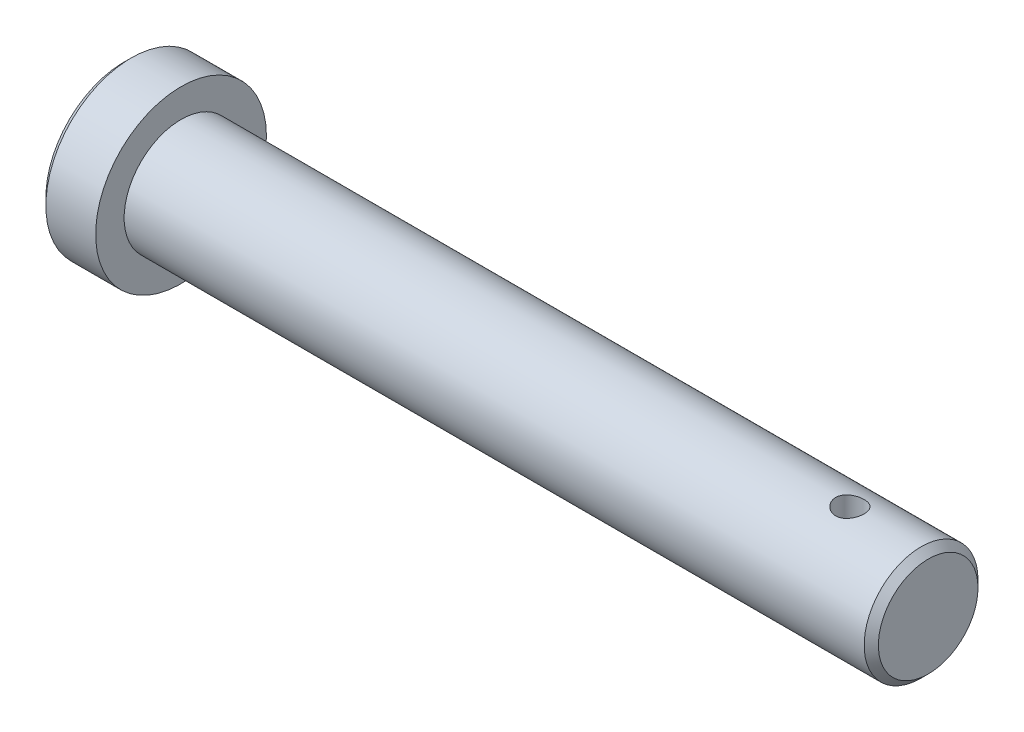
ISO-10303-21;
HEADER;
FILE_DESCRIPTION(('STEP AP214'),'2;1');
FILE_NAME('part.step','',(''),(''),'','','');
FILE_SCHEMA(('AUTOMOTIVE_DESIGN { 1 0 10303 214 1 1 1 1 }'));
ENDSEC;
DATA;
#1=APPLICATION_CONTEXT('core data for automotive mechanical design processes');
#2=APPLICATION_PROTOCOL_DEFINITION('international standard','automotive_design',2000,#1);
#3=PRODUCT_CONTEXT('',#1,'mechanical');
#4=PRODUCT('Part','Part','',(#3));
#5=PRODUCT_RELATED_PRODUCT_CATEGORY('part','',(#4));
#6=PRODUCT_DEFINITION_FORMATION('','',#4);
#7=PRODUCT_DEFINITION_CONTEXT('part definition',#1,'design');
#8=PRODUCT_DEFINITION('design','',#6,#7);
#9=PRODUCT_DEFINITION_SHAPE('','',#8);
#10=(LENGTH_UNIT() NAMED_UNIT(*) SI_UNIT(.MILLI.,.METRE.));
#11=(NAMED_UNIT(*) PLANE_ANGLE_UNIT() SI_UNIT($,.RADIAN.));
#12=(NAMED_UNIT(*) SI_UNIT($,.STERADIAN.) SOLID_ANGLE_UNIT());
#13=UNCERTAINTY_MEASURE_WITH_UNIT(LENGTH_MEASURE(1.E-05),#10,'distance_accuracy_value','');
#14=(GEOMETRIC_REPRESENTATION_CONTEXT(3) GLOBAL_UNCERTAINTY_ASSIGNED_CONTEXT((#13)) GLOBAL_UNIT_ASSIGNED_CONTEXT((#10,
#11,#12)) REPRESENTATION_CONTEXT('',''));
#15=CARTESIAN_POINT('',(0.,0.,0.));
#16=DIRECTION('',(0.,0.,1.));
#17=DIRECTION('',(1.,0.,0.));
#18=AXIS2_PLACEMENT_3D('',#15,#16,#17);
#19=CARTESIAN_POINT('',(8.,0.,0.));
#20=DIRECTION('',(1.,0.,0.));
#21=DIRECTION('',(0.,0.,-1.));
#22=AXIS2_PLACEMENT_3D('',#19,#20,#21);
#23=PLANE('',#22);
#24=CARTESIAN_POINT('',(8.,0.,0.));
#25=DIRECTION('',(1.,0.,0.));
#26=DIRECTION('',(0.,0.,-1.));
#27=AXIS2_PLACEMENT_3D('',#24,#25,#26);
#28=CIRCLE('',#27,12.);
#29=CARTESIAN_POINT('',(8.,0.,-12.));
#30=VERTEX_POINT('',#29);
#31=EDGE_CURVE('E98',#30,#30,#28,.T.);
#32=ORIENTED_EDGE('',*,*,#31,.T.);
#33=EDGE_LOOP('',(#32));
#34=FACE_BOUND('',#33,.T.);
#35=CARTESIAN_POINT('',(8.,0.,0.));
#36=DIRECTION('',(1.,0.,0.));
#37=DIRECTION('',(0.,0.,-1.));
#38=AXIS2_PLACEMENT_3D('',#35,#36,#37);
#39=CIRCLE('',#38,8.);
#40=CARTESIAN_POINT('',(8.,0.,-8.));
#41=VERTEX_POINT('',#40);
#42=EDGE_CURVE('E100',#41,#41,#39,.T.);
#43=ORIENTED_EDGE('',*,*,#42,.F.);
#44=EDGE_LOOP('',(#43));
#45=FACE_BOUND('',#44,.T.);
#46=ADVANCED_FACE('F31',(#34,#45),#23,.T.);
#47=CARTESIAN_POINT('',(8.,0.,0.));
#48=DIRECTION('',(-1.,0.,0.));
#49=DIRECTION('',(0.,0.,1.));
#50=AXIS2_PLACEMENT_3D('',#47,#48,#49);
#51=CYLINDRICAL_SURFACE('',#50,12.);
#52=CARTESIAN_POINT('',(1.,0.,0.));
#53=DIRECTION('',(1.,0.,0.));
#54=DIRECTION('',(0.,0.,-1.));
#55=AXIS2_PLACEMENT_3D('',#52,#53,#54);
#56=CIRCLE('',#55,12.);
#57=CARTESIAN_POINT('',(1.,0.,-12.));
#58=VERTEX_POINT('',#57);
#59=EDGE_CURVE('E97',#58,#58,#56,.T.);
#60=ORIENTED_EDGE('',*,*,#59,.T.);
#61=EDGE_LOOP('',(#60));
#62=FACE_BOUND('',#61,.T.);
#63=ORIENTED_EDGE('',*,*,#31,.F.);
#64=EDGE_LOOP('',(#63));
#65=FACE_BOUND('',#64,.T.);
#66=ADVANCED_FACE('F75',(#62,#65),#51,.T.);
#67=CARTESIAN_POINT('',(0.,0.,0.));
#68=DIRECTION('',(1.,0.,0.));
#69=DIRECTION('',(0.,0.,-1.));
#70=AXIS2_PLACEMENT_3D('',#67,#68,#69);
#71=PLANE('',#70);
#72=CARTESIAN_POINT('',(0.,0.,0.));
#73=DIRECTION('',(1.,0.,0.));
#74=DIRECTION('',(0.,0.,-1.));
#75=AXIS2_PLACEMENT_3D('',#72,#73,#74);
#76=CIRCLE('',#75,11.);
#77=CARTESIAN_POINT('',(0.,0.,-11.));
#78=VERTEX_POINT('',#77);
#79=EDGE_CURVE('E48',#78,#78,#76,.F.);
#80=ORIENTED_EDGE('',*,*,#79,.T.);
#81=EDGE_LOOP('',(#80));
#82=FACE_BOUND('',#81,.T.);
#83=ADVANCED_FACE('F80',(#82),#71,.F.);
#84=CARTESIAN_POINT('',(1.,0.,0.));
#85=DIRECTION('',(1.,0.,0.));
#86=DIRECTION('',(0.,0.,-1.));
#87=AXIS2_PLACEMENT_3D('',#84,#85,#86);
#88=CONICAL_SURFACE('',#87,12.,0.78539816339745);
#89=ORIENTED_EDGE('',*,*,#79,.F.);
#90=EDGE_LOOP('',(#89));
#91=FACE_BOUND('',#90,.T.);
#92=ORIENTED_EDGE('',*,*,#59,.F.);
#93=EDGE_LOOP('',(#92));
#94=FACE_BOUND('',#93,.T.);
#95=ADVANCED_FACE('F72',(#91,#94),#88,.T.);
#96=CARTESIAN_POINT('',(113.,0.,0.));
#97=DIRECTION('',(-1.,0.,0.));
#98=DIRECTION('',(0.,0.,1.));
#99=AXIS2_PLACEMENT_3D('',#96,#97,#98);
#100=CYLINDRICAL_SURFACE('',#99,8.);
#101=CARTESIAN_POINT('',(102.,-7.74596669241483,2.));
#102=CARTESIAN_POINT('',(102.110440600741,-7.74596880070288,1.99999686287445));
#103=CARTESIAN_POINT('',(102.220915918943,-7.74835444811678,1.99082099639812));
#104=CARTESIAN_POINT('',(102.438694062539,-7.75761489594051,1.95441850037103));
#105=CARTESIAN_POINT('',(102.545995003575,-7.76449230897304,1.92718136539368));
#106=CARTESIAN_POINT('',(102.75424283055,-7.7819097967692,1.85559295970563));
#107=CARTESIAN_POINT('',(102.855197724309,-7.79244514152366,1.81126378228359));
#108=CARTESIAN_POINT('',(103.048248682032,-7.81598553623007,1.70681691300911));
#109=CARTESIAN_POINT('',(103.140344369664,-7.82899069102791,1.64669855084855));
#110=CARTESIAN_POINT('',(103.31508931621,-7.856325730845,1.51096674184951));
#111=CARTESIAN_POINT('',(103.39751488028,-7.87067678098427,1.43506951016325));
#112=CARTESIAN_POINT('',(103.548609115488,-7.89890300412235,1.27054565128054));
#113=CARTESIAN_POINT('',(103.617276500497,-7.91277813253111,1.18191783534426));
#114=CARTESIAN_POINT('',(103.739820374105,-7.93872332416466,0.992916160863172));
#115=CARTESIAN_POINT('',(103.793477110529,-7.95076549920474,0.892395660956105));
#116=CARTESIAN_POINT('',(103.883047715322,-7.97144649540787,0.683410547434216));
#117=CARTESIAN_POINT('',(103.918964201532,-7.98008581867475,0.574947108633554));
#118=CARTESIAN_POINT('',(103.971318267663,-7.99283807078544,0.355487007003329));
#119=CARTESIAN_POINT('',(103.988135715461,-7.99703915075451,0.244586175639181));
#120=CARTESIAN_POINT('',(104.00300670342,-8.00074875285838,0.0214630554102188));
#121=CARTESIAN_POINT('',(104.001063017768,-8.00025796877363,-0.0907590356304507));
#122=CARTESIAN_POINT('',(103.9787401198,-7.99470475962828,-0.310704494344769));
#123=CARTESIAN_POINT('',(103.958770939957,-7.98974401872699,-0.418472431202127));
#124=CARTESIAN_POINT('',(103.901622983961,-7.97592669219883,-0.629076494827365));
#125=CARTESIAN_POINT('',(103.864443291698,-7.96706989918753,-0.73191235874087));
#126=CARTESIAN_POINT('',(103.77359794345,-7.94630007760716,-0.930813407003608));
#127=CARTESIAN_POINT('',(103.719786364271,-7.93436015756043,-1.026809019533));
#128=CARTESIAN_POINT('',(103.597315456707,-7.90871923047719,-1.20855124468097));
#129=CARTESIAN_POINT('',(103.528653545151,-7.89501791721992,-1.29429607017101));
#130=CARTESIAN_POINT('',(103.376233006414,-7.86690971015616,-1.4555480701699));
#131=CARTESIAN_POINT('',(103.292116086122,-7.85249375620734,-1.53071535815039));
#132=CARTESIAN_POINT('',(103.112320021168,-7.82492034813365,-1.66595275192603));
#133=CARTESIAN_POINT('',(103.016640336407,-7.81176295284777,-1.72602215209203));
#134=CARTESIAN_POINT('',(102.815767972681,-7.78816397465319,-1.82957625804519));
#135=CARTESIAN_POINT('',(102.710531415749,-7.77773586980577,-1.87297913394098));
#136=CARTESIAN_POINT('',(102.493931625539,-7.76094912111966,-1.94137124127268));
#137=CARTESIAN_POINT('',(102.382569708813,-7.75458960648175,-1.96636441310582));
#138=CARTESIAN_POINT('',(102.160032398781,-7.74684284831313,-1.99666371093214));
#139=CARTESIAN_POINT('',(102.048929765336,-7.74532871274919,-2.0024723791357));
#140=CARTESIAN_POINT('',(101.827342450737,-7.74709874784831,-1.99561359241243));
#141=CARTESIAN_POINT('',(101.716857713639,-7.75038247681013,-1.98294783827904));
#142=CARTESIAN_POINT('',(101.501508588036,-7.76125665563648,-1.93994037115013));
#143=CARTESIAN_POINT('',(101.396581818743,-7.768775761875,-1.90989125462539));
#144=CARTESIAN_POINT('',(101.193254833719,-7.7872057461677,-1.83329446533649));
#145=CARTESIAN_POINT('',(101.094855392756,-7.79811702598891,-1.78674483817003));
#146=CARTESIAN_POINT('',(100.905246977706,-7.8223690967461,-1.67741653434924));
#147=CARTESIAN_POINT('',(100.814216927966,-7.83575334885314,-1.61433740306849));
#148=CARTESIAN_POINT('',(100.643849309759,-7.86333666457373,-1.4741205858689));
#149=CARTESIAN_POINT('',(100.56451366668,-7.87753586182776,-1.39698058961087));
#150=CARTESIAN_POINT('',(100.417751165943,-7.90557922425285,-1.22852544196944));
#151=CARTESIAN_POINT('',(100.350671949961,-7.91940561649468,-1.13690390506318));
#152=CARTESIAN_POINT('',(100.232851306439,-7.94477773290987,-0.943405365389353));
#153=CARTESIAN_POINT('',(100.182109026713,-7.95632357603169,-0.841528897915187));
#154=CARTESIAN_POINT('',(100.098843172378,-7.9757609259065,-0.631116403462189));
#155=CARTESIAN_POINT('',(100.066188572497,-7.98367864017925,-0.522634762055773));
#156=CARTESIAN_POINT('',(100.019631732313,-7.99508234716634,-0.301499520637622));
#157=CARTESIAN_POINT('',(100.005725873009,-7.99856919514738,-0.188846730082488));
#158=CARTESIAN_POINT('',(99.9972648208489,-8.00068338817612,0.0341670528866387));
#159=CARTESIAN_POINT('',(100.002196581809,-7.99943957759977,0.144507653932035));
#160=CARTESIAN_POINT('',(100.030095654589,-7.99251792914887,0.362734992829493));
#161=CARTESIAN_POINT('',(100.053062430026,-7.98684022314338,0.470621803561851));
#162=CARTESIAN_POINT('',(100.116104439542,-7.97170865707778,0.680342071289543));
#163=CARTESIAN_POINT('',(100.156086906629,-7.96227529004785,0.782204989161721));
#164=CARTESIAN_POINT('',(100.251941158039,-7.94062577827316,0.977834106083244));
#165=CARTESIAN_POINT('',(100.307814945341,-7.92840928277515,1.07159928253126));
#166=CARTESIAN_POINT('',(100.435430467992,-7.90214499360574,1.2508038568466));
#167=CARTESIAN_POINT('',(100.507520285808,-7.88806033883329,1.33598997659666));
#168=CARTESIAN_POINT('',(100.664845703955,-7.8598129811438,1.493230040547));
#169=CARTESIAN_POINT('',(100.750084632222,-7.84565025934605,1.56528065015317));
#170=CARTESIAN_POINT('',(100.933202828379,-7.81854951691005,1.69552405294366));
#171=CARTESIAN_POINT('',(101.03128824673,-7.80563927346578,1.75343323883275));
#172=CARTESIAN_POINT('',(101.23611097975,-7.78287910989656,1.85185379317093));
#173=CARTESIAN_POINT('',(101.342841932188,-7.77302696466428,1.8923778195043));
#174=CARTESIAN_POINT('',(101.54115402367,-7.75903817501475,1.948845057142));
#175=CARTESIAN_POINT('',(101.631786328772,-7.75417326006998,1.96798634119375));
#176=CARTESIAN_POINT('',(101.814937737995,-7.7476367716524,1.99356458514353));
#177=CARTESIAN_POINT('',(101.907456680489,-7.74596492578216,2.0000026287435));
#178=CARTESIAN_POINT('',(102.,-7.74596669241483,2.));
#179=B_SPLINE_CURVE_WITH_KNOTS('',3,(#101,#102,#103,#104,#105,#106,#107,#108,#109,#110,#111,
#112,#113,#114,#115,#116,#117,#118,#119,#120,#121,#122,#123,#124,#125,#126,#127,#128,#129,#130,
#131,#132,#133,#134,#135,#136,#137,#138,#139,#140,#141,#142,#143,#144,#145,#146,#147,#148,#149,
#150,#151,#152,#153,#154,#155,#156,#157,#158,#159,#160,#161,#162,#163,#164,#165,#166,#167,#168,
#169,#170,#171,#172,#173,#174,#175,#176,#177,#178),.UNSPECIFIED.,.T.,.F.,(4,2,2,2,2,2,2,2,2,2,2,
2,2,2,2,2,2,2,2,2,2,2,2,2,2,2,2,2,2,2,2,2,2,2,2,2,2,2,4),(0.,0.330981953388902,
0.662156593142927,0.992904581732803,1.32366661404381,1.66099163354378,1.99834817183891,
2.34041197118335,2.68242527877673,3.01751000796276,3.35254518932815,3.68014610151156,
4.00776445379828,4.33834299403555,4.66897908375129,5.00856373257526,5.3481642495984,
5.6894114560672,6.03058560103637,6.36274859809372,6.69488101747039,7.02157924007365,
7.34831617137133,7.68146276687326,8.01466415108035,8.35620264772253,8.6977233257564,
9.03673658245541,9.37568439127228,9.70546756901963,10.0352409390158,10.3632390124777,
10.6912784459046,11.0271767726565,11.363160252524,11.7054118182895,12.0474137709605,
12.3247826174462,12.6021278008237),.UNSPECIFIED.);
#180=CARTESIAN_POINT('',(102.,-7.74596669241483,2.));
#181=VERTEX_POINT('',#180);
#182=EDGE_CURVE('E35',#181,#181,#179,.T.);
#183=ORIENTED_EDGE('',*,*,#182,.T.);
#184=EDGE_LOOP('',(#183));
#185=FACE_BOUND('',#184,.T.);
#186=CARTESIAN_POINT('',(102.,7.74596669241483,2.));
#187=CARTESIAN_POINT('',(101.889559399259,7.74596880070288,1.99999686287445));
#188=CARTESIAN_POINT('',(101.779084081057,7.74835444811678,1.99082099639812));
#189=CARTESIAN_POINT('',(101.561305937461,7.75761489594051,1.95441850037103));
#190=CARTESIAN_POINT('',(101.454004996425,7.76449230897304,1.92718136539368));
#191=CARTESIAN_POINT('',(101.24575716945,7.7819097967692,1.85559295970563));
#192=CARTESIAN_POINT('',(101.144802275691,7.79244514152366,1.81126378228359));
#193=CARTESIAN_POINT('',(100.951751317968,7.81598553623007,1.70681691300911));
#194=CARTESIAN_POINT('',(100.859655630336,7.82899069102791,1.64669855084855));
#195=CARTESIAN_POINT('',(100.68491068379,7.856325730845,1.51096674184951));
#196=CARTESIAN_POINT('',(100.60248511972,7.87067678098427,1.43506951016325));
#197=CARTESIAN_POINT('',(100.451390884512,7.89890300412235,1.27054565128054));
#198=CARTESIAN_POINT('',(100.382723499503,7.91277813253111,1.18191783534426));
#199=CARTESIAN_POINT('',(100.260179625895,7.93872332416466,0.992916160863172));
#200=CARTESIAN_POINT('',(100.206522889471,7.95076549920474,0.892395660956105));
#201=CARTESIAN_POINT('',(100.116952284678,7.97144649540787,0.683410547434216));
#202=CARTESIAN_POINT('',(100.081035798468,7.98008581867475,0.574947108633554));
#203=CARTESIAN_POINT('',(100.028681732337,7.99283807078544,0.355487007003329));
#204=CARTESIAN_POINT('',(100.011864284539,7.99703915075451,0.244586175639181));
#205=CARTESIAN_POINT('',(99.9969932965796,8.00074875285838,0.0214630554102188));
#206=CARTESIAN_POINT('',(99.9989369822323,8.00025796877363,-0.0907590356304507));
#207=CARTESIAN_POINT('',(100.0212598802,7.99470475962828,-0.310704494344769));
#208=CARTESIAN_POINT('',(100.041229060043,7.98974401872699,-0.418472431202127));
#209=CARTESIAN_POINT('',(100.098377016039,7.97592669219883,-0.629076494827365));
#210=CARTESIAN_POINT('',(100.135556708302,7.96706989918753,-0.73191235874087));
#211=CARTESIAN_POINT('',(100.22640205655,7.94630007760716,-0.930813407003608));
#212=CARTESIAN_POINT('',(100.280213635729,7.93436015756043,-1.026809019533));
#213=CARTESIAN_POINT('',(100.402684543293,7.90871923047719,-1.20855124468097));
#214=CARTESIAN_POINT('',(100.471346454849,7.89501791721992,-1.29429607017101));
#215=CARTESIAN_POINT('',(100.623766993586,7.86690971015616,-1.4555480701699));
#216=CARTESIAN_POINT('',(100.707883913878,7.85249375620734,-1.53071535815039));
#217=CARTESIAN_POINT('',(100.887679978832,7.82492034813365,-1.66595275192603));
#218=CARTESIAN_POINT('',(100.983359663593,7.81176295284777,-1.72602215209203));
#219=CARTESIAN_POINT('',(101.184232027319,7.78816397465319,-1.82957625804519));
#220=CARTESIAN_POINT('',(101.289468584251,7.77773586980577,-1.87297913394098));
#221=CARTESIAN_POINT('',(101.506068374461,7.76094912111966,-1.94137124127268));
#222=CARTESIAN_POINT('',(101.617430291186,7.75458960648175,-1.96636441310582));
#223=CARTESIAN_POINT('',(101.839967601218,7.74684284831313,-1.99666371093214));
#224=CARTESIAN_POINT('',(101.951070234664,7.74532871274919,-2.0024723791357));
#225=CARTESIAN_POINT('',(102.172657549263,7.74709874784831,-1.99561359241243));
#226=CARTESIAN_POINT('',(102.283142286361,7.75038247681013,-1.98294783827904));
#227=CARTESIAN_POINT('',(102.498491411964,7.76125665563648,-1.93994037115013));
#228=CARTESIAN_POINT('',(102.603418181257,7.768775761875,-1.9098912546254));
#229=CARTESIAN_POINT('',(102.806745166281,7.7872057461677,-1.8332944653365));
#230=CARTESIAN_POINT('',(102.905144607244,7.79811702598891,-1.78674483817003));
#231=CARTESIAN_POINT('',(103.094753022294,7.8223690967461,-1.67741653434924));
#232=CARTESIAN_POINT('',(103.185783072034,7.83575334885313,-1.6143374030685));
#233=CARTESIAN_POINT('',(103.356150690241,7.86333666457373,-1.4741205858689));
#234=CARTESIAN_POINT('',(103.43548633332,7.87753586182776,-1.39698058961087));
#235=CARTESIAN_POINT('',(103.582248834057,7.90557922425285,-1.22852544196944));
#236=CARTESIAN_POINT('',(103.649328050039,7.91940561649468,-1.13690390506318));
#237=CARTESIAN_POINT('',(103.767148693561,7.94477773290987,-0.943405365389353));
#238=CARTESIAN_POINT('',(103.817890973287,7.95632357603169,-0.841528897915187));
#239=CARTESIAN_POINT('',(103.901156827622,7.9757609259065,-0.631116403462189));
#240=CARTESIAN_POINT('',(103.933811427503,7.98367864017925,-0.522634762055773));
#241=CARTESIAN_POINT('',(103.980368267687,7.99508234716634,-0.301499520637622));
#242=CARTESIAN_POINT('',(103.994274126991,7.99856919514738,-0.188846730082488));
#243=CARTESIAN_POINT('',(104.002735179151,8.00068338817612,0.0341670528866387));
#244=CARTESIAN_POINT('',(103.997803418191,7.99943957759977,0.144507653932035));
#245=CARTESIAN_POINT('',(103.969904345411,7.99251792914887,0.362734992829493));
#246=CARTESIAN_POINT('',(103.946937569974,7.98684022314338,0.470621803561851));
#247=CARTESIAN_POINT('',(103.883895560458,7.97170865707778,0.680342071289542));
#248=CARTESIAN_POINT('',(103.843913093371,7.96227529004785,0.782204989161717));
#249=CARTESIAN_POINT('',(103.748058841961,7.94062577827316,0.977834106083241));
#250=CARTESIAN_POINT('',(103.692185054659,7.92840928277515,1.07159928253126));
#251=CARTESIAN_POINT('',(103.564569532008,7.90214499360574,1.2508038568466));
#252=CARTESIAN_POINT('',(103.492479714192,7.88806033883329,1.33598997659666));
#253=CARTESIAN_POINT('',(103.335154296045,7.8598129811438,1.493230040547));
#254=CARTESIAN_POINT('',(103.249915367778,7.84565025934605,1.56528065015317));
#255=CARTESIAN_POINT('',(103.066797171621,7.81854951691005,1.69552405294366));
#256=CARTESIAN_POINT('',(102.968711753269,7.80563927346578,1.75343323883275));
#257=CARTESIAN_POINT('',(102.76388902025,7.78287910989656,1.85185379317093));
#258=CARTESIAN_POINT('',(102.657158067812,7.77302696466428,1.8923778195043));
#259=CARTESIAN_POINT('',(102.45884597633,7.75903817501475,1.948845057142));
#260=CARTESIAN_POINT('',(102.368213671228,7.75417326006998,1.96798634119375));
#261=CARTESIAN_POINT('',(102.185062262005,7.7476367716524,1.99356458514353));
#262=CARTESIAN_POINT('',(102.092543319511,7.74596492578216,2.0000026287435));
#263=CARTESIAN_POINT('',(102.,7.74596669241483,2.));
#264=B_SPLINE_CURVE_WITH_KNOTS('',3,(#186,#187,#188,#189,#190,#191,#192,#193,#194,#195,#196,
#197,#198,#199,#200,#201,#202,#203,#204,#205,#206,#207,#208,#209,#210,#211,#212,#213,#214,#215,
#216,#217,#218,#219,#220,#221,#222,#223,#224,#225,#226,#227,#228,#229,#230,#231,#232,#233,#234,
#235,#236,#237,#238,#239,#240,#241,#242,#243,#244,#245,#246,#247,#248,#249,#250,#251,#252,#253,
#254,#255,#256,#257,#258,#259,#260,#261,#262,#263),.UNSPECIFIED.,.T.,.F.,(4,2,2,2,2,2,2,2,2,2,2,
2,2,2,2,2,2,2,2,2,2,2,2,2,2,2,2,2,2,2,2,2,2,2,2,2,2,2,4),(0.,0.330981953388917,
0.662156593142927,0.992904581732803,1.32366661404381,1.66099163354378,1.99834817183891,
2.34041197118335,2.68242527877673,3.01751000796276,3.35254518932815,3.68014610151156,
4.00776445379828,4.33834299403555,4.66897908375129,5.00856373257526,5.3481642495984,
5.6894114560672,6.03058560103637,6.36274859809372,6.69488101747039,7.02157924007363,
7.34831617137133,7.68146276687325,8.01466415108035,8.35620264772253,8.6977233257564,
9.03673658245541,9.37568439127228,9.70546756901963,10.0352409390158,10.3632390124777,
10.6912784459046,11.0271767726565,11.363160252524,11.7054118182895,12.0474137709605,
12.3247826174462,12.6021278008237),.UNSPECIFIED.);
#265=CARTESIAN_POINT('',(102.,7.74596669241483,2.));
#266=VERTEX_POINT('',#265);
#267=EDGE_CURVE('E51',#266,#266,#264,.T.);
#268=ORIENTED_EDGE('',*,*,#267,.T.);
#269=EDGE_LOOP('',(#268));
#270=FACE_BOUND('',#269,.T.);
#271=CARTESIAN_POINT('',(112.,0.,0.));
#272=DIRECTION('',(1.,0.,0.));
#273=DIRECTION('',(0.,0.,-1.));
#274=AXIS2_PLACEMENT_3D('',#271,#272,#273);
#275=CIRCLE('',#274,8.);
#276=CARTESIAN_POINT('',(112.,0.,-8.));
#277=VERTEX_POINT('',#276);
#278=EDGE_CURVE('E10',#277,#277,#275,.F.);
#279=ORIENTED_EDGE('',*,*,#278,.T.);
#280=EDGE_LOOP('',(#279));
#281=FACE_BOUND('',#280,.T.);
#282=ORIENTED_EDGE('',*,*,#42,.T.);
#283=EDGE_LOOP('',(#282));
#284=FACE_BOUND('',#283,.T.);
#285=ADVANCED_FACE('F55',(#185,#270,#281,#284),#100,.T.);
#286=CARTESIAN_POINT('',(113.,0.,0.));
#287=DIRECTION('',(1.,0.,0.));
#288=DIRECTION('',(0.,0.,-1.));
#289=AXIS2_PLACEMENT_3D('',#286,#287,#288);
#290=PLANE('',#289);
#291=CARTESIAN_POINT('',(113.,0.,0.));
#292=DIRECTION('',(1.,0.,0.));
#293=DIRECTION('',(0.,0.,-1.));
#294=AXIS2_PLACEMENT_3D('',#291,#292,#293);
#295=CIRCLE('',#294,7.00000000000001);
#296=CARTESIAN_POINT('',(113.,0.,-7.00000000000001));
#297=VERTEX_POINT('',#296);
#298=EDGE_CURVE('E43',#297,#297,#295,.T.);
#299=ORIENTED_EDGE('',*,*,#298,.T.);
#300=EDGE_LOOP('',(#299));
#301=FACE_BOUND('',#300,.T.);
#302=ADVANCED_FACE('F63',(#301),#290,.T.);
#303=CARTESIAN_POINT('',(113.,0.,0.));
#304=DIRECTION('',(-1.,0.,0.));
#305=DIRECTION('',(0.,0.,1.));
#306=AXIS2_PLACEMENT_3D('',#303,#304,#305);
#307=CONICAL_SURFACE('',#306,7.00000000000001,0.785398163397445);
#308=ORIENTED_EDGE('',*,*,#278,.F.);
#309=EDGE_LOOP('',(#308));
#310=FACE_BOUND('',#309,.T.);
#311=ORIENTED_EDGE('',*,*,#298,.F.);
#312=EDGE_LOOP('',(#311));
#313=FACE_BOUND('',#312,.T.);
#314=ADVANCED_FACE('F33',(#310,#313),#307,.T.);
#315=CARTESIAN_POINT('',(102.,-52.5,0.));
#316=DIRECTION('',(0.,1.,0.));
#317=DIRECTION('',(0.,0.,1.));
#318=AXIS2_PLACEMENT_3D('',#315,#316,#317);
#319=CYLINDRICAL_SURFACE('',#318,2.);
#320=ORIENTED_EDGE('',*,*,#267,.F.);
#321=EDGE_LOOP('',(#320));
#322=FACE_BOUND('',#321,.T.);
#323=ORIENTED_EDGE('',*,*,#182,.F.);
#324=EDGE_LOOP('',(#323));
#325=FACE_BOUND('',#324,.T.);
#326=ADVANCED_FACE('F59',(#322,#325),#319,.F.);
#327=CLOSED_SHELL('',(#46,#66,#83,#95,#285,#302,#314,#326));
#328=MANIFOLD_SOLID_BREP('B2',#327);
#329=ADVANCED_BREP_SHAPE_REPRESENTATION('',(#18,#328),#14);
#330=SHAPE_DEFINITION_REPRESENTATION(#9,#329);
ENDSEC;
END-ISO-10303-21;
